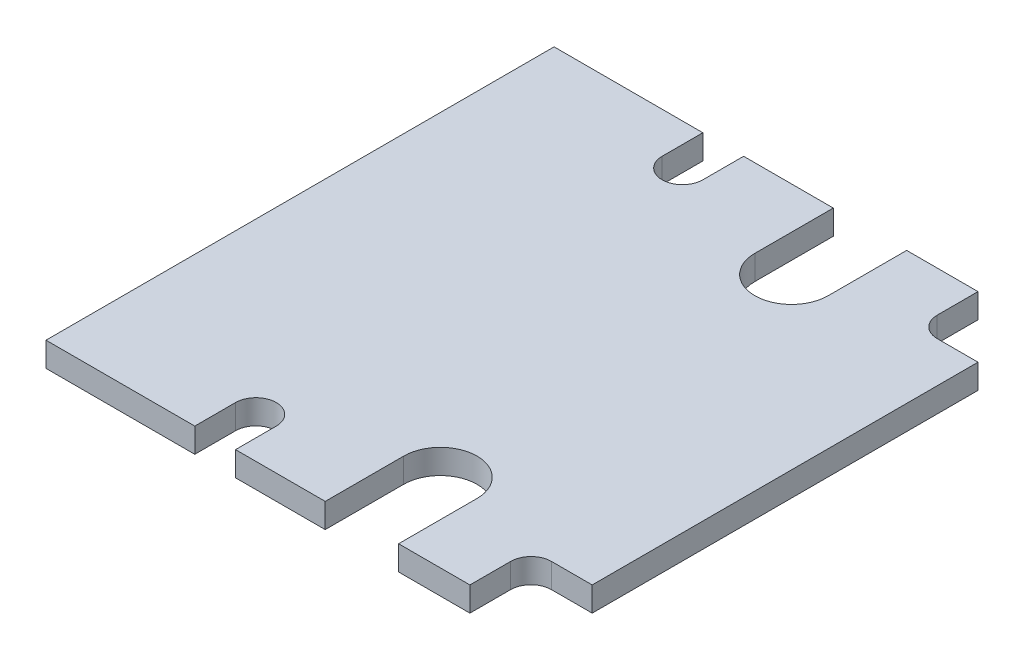
ISO-10303-21;
HEADER;
FILE_DESCRIPTION(('STEP AP214'),'2;1');
FILE_NAME('part.step','',(''),(''),'','','');
FILE_SCHEMA(('AUTOMOTIVE_DESIGN { 1 0 10303 214 1 1 1 1 }'));
ENDSEC;
DATA;
#1=APPLICATION_CONTEXT('core data for automotive mechanical design processes');
#2=APPLICATION_PROTOCOL_DEFINITION('international standard','automotive_design',2000,#1);
#3=PRODUCT_CONTEXT('',#1,'mechanical');
#4=PRODUCT('Part','Part','',(#3));
#5=PRODUCT_RELATED_PRODUCT_CATEGORY('part','',(#4));
#6=PRODUCT_DEFINITION_FORMATION('','',#4);
#7=PRODUCT_DEFINITION_CONTEXT('part definition',#1,'design');
#8=PRODUCT_DEFINITION('design','',#6,#7);
#9=PRODUCT_DEFINITION_SHAPE('','',#8);
#10=(LENGTH_UNIT() NAMED_UNIT(*) SI_UNIT(.MILLI.,.METRE.));
#11=(NAMED_UNIT(*) PLANE_ANGLE_UNIT() SI_UNIT($,.RADIAN.));
#12=(NAMED_UNIT(*) SI_UNIT($,.STERADIAN.) SOLID_ANGLE_UNIT());
#13=UNCERTAINTY_MEASURE_WITH_UNIT(LENGTH_MEASURE(1.E-05),#10,'distance_accuracy_value','');
#14=(GEOMETRIC_REPRESENTATION_CONTEXT(3) GLOBAL_UNCERTAINTY_ASSIGNED_CONTEXT((#13)) GLOBAL_UNIT_ASSIGNED_CONTEXT((#10,
#11,#12)) REPRESENTATION_CONTEXT('',''));
#15=CARTESIAN_POINT('',(0.,0.,0.));
#16=DIRECTION('',(0.,0.,1.));
#17=DIRECTION('',(1.,0.,0.));
#18=AXIS2_PLACEMENT_3D('',#15,#16,#17);
#19=CARTESIAN_POINT('',(-8.751968503937,1.2,13.9045406824147));
#20=DIRECTION('',(0.,0.,-1.));
#21=DIRECTION('',(-1.,0.,0.));
#22=AXIS2_PLACEMENT_3D('',#19,#20,#21);
#23=PLANE('',#22);
#24=DIRECTION('',(0.,1.,0.));
#25=VECTOR('',#24,1.);
#26=CARTESIAN_POINT('',(-0.751968503937004,0.,13.9045406824147));
#27=LINE('',#26,#25);
#28=CARTESIAN_POINT('',(-0.751968503937004,0.,13.9045406824147));
#29=VERTEX_POINT('',#28);
#30=CARTESIAN_POINT('',(-0.751968503937004,1.2,13.9045406824147));
#31=VERTEX_POINT('',#30);
#32=EDGE_CURVE('E239',#29,#31,#27,.T.);
#33=ORIENTED_EDGE('',*,*,#32,.F.);
#34=DIRECTION('',(1.,0.,0.));
#35=VECTOR('',#34,1.);
#36=CARTESIAN_POINT('',(-8.751968503937,0.,13.9045406824147));
#37=LINE('',#36,#35);
#38=CARTESIAN_POINT('',(2.74803149606299,0.,13.9045406824147));
#39=VERTEX_POINT('',#38);
#40=EDGE_CURVE('E318',#29,#39,#37,.T.);
#41=ORIENTED_EDGE('',*,*,#40,.T.);
#42=DIRECTION('',(0.,-1.,0.));
#43=VECTOR('',#42,1.);
#44=CARTESIAN_POINT('',(2.74803149606299,1.2,13.9045406824147));
#45=LINE('',#44,#43);
#46=CARTESIAN_POINT('',(2.74803149606299,1.2,13.9045406824147));
#47=VERTEX_POINT('',#46);
#48=EDGE_CURVE('E381',#47,#39,#45,.T.);
#49=ORIENTED_EDGE('',*,*,#48,.F.);
#50=DIRECTION('',(1.,0.,0.));
#51=VECTOR('',#50,1.);
#52=CARTESIAN_POINT('',(-8.751968503937,1.2,13.9045406824147));
#53=LINE('',#52,#51);
#54=EDGE_CURVE('E277',#31,#47,#53,.T.);
#55=ORIENTED_EDGE('',*,*,#54,.F.);
#56=EDGE_LOOP('',(#33,#41,#49,#55));
#57=FACE_BOUND('',#56,.T.);
#58=ADVANCED_FACE('F33',(#57),#23,.F.);
#59=DIRECTION('',(0.,1.,0.));
#60=VECTOR('',#59,1.);
#61=CARTESIAN_POINT('',(-4.351968503937,0.,13.9045406824147));
#62=LINE('',#61,#60);
#63=CARTESIAN_POINT('',(-4.351968503937,0.,13.9045406824147));
#64=VERTEX_POINT('',#63);
#65=CARTESIAN_POINT('',(-4.351968503937,1.2,13.9045406824147));
#66=VERTEX_POINT('',#65);
#67=EDGE_CURVE('E48',#64,#66,#62,.T.);
#68=ORIENTED_EDGE('',*,*,#67,.T.);
#69=CARTESIAN_POINT('',(-8.751968503937,1.2,13.9045406824147));
#70=VERTEX_POINT('',#69);
#71=EDGE_CURVE('E278',#70,#66,#53,.T.);
#72=ORIENTED_EDGE('',*,*,#71,.F.);
#73=DIRECTION('',(0.,-1.,0.));
#74=VECTOR('',#73,1.);
#75=CARTESIAN_POINT('',(-8.751968503937,1.2,13.9045406824147));
#76=LINE('',#75,#74);
#77=CARTESIAN_POINT('',(-8.751968503937,0.,13.9045406824147));
#78=VERTEX_POINT('',#77);
#79=EDGE_CURVE('E384',#70,#78,#76,.T.);
#80=ORIENTED_EDGE('',*,*,#79,.T.);
#81=EDGE_CURVE('E319',#78,#64,#37,.T.);
#82=ORIENTED_EDGE('',*,*,#81,.T.);
#83=EDGE_LOOP('',(#68,#72,#80,#82));
#84=FACE_BOUND('',#83,.T.);
#85=ADVANCED_FACE('F498',(#84),#23,.F.);
#86=CARTESIAN_POINT('',(-9.751968503937,1.2,11.9045406824147));
#87=DIRECTION('',(0.,1.,0.));
#88=DIRECTION('',(0.,0.,1.));
#89=AXIS2_PLACEMENT_3D('',#86,#87,#88);
#90=PLANE('',#89);
#91=CARTESIAN_POINT('',(-2.551968503937,1.2,10.0545406824147));
#92=DIRECTION('',(0.,-1.,0.));
#93=DIRECTION('',(0.,0.,-1.));
#94=AXIS2_PLACEMENT_3D('',#91,#92,#93);
#95=CIRCLE('',#94,1.8);
#96=CARTESIAN_POINT('',(-4.351968503937,1.2,10.0545406824147));
#97=VERTEX_POINT('',#96);
#98=CARTESIAN_POINT('',(-0.751968503937003,1.2,10.0545406824147));
#99=VERTEX_POINT('',#98);
#100=EDGE_CURVE('E221',#97,#99,#95,.T.);
#101=ORIENTED_EDGE('',*,*,#100,.T.);
#102=DIRECTION('',(0.,0.,1.));
#103=VECTOR('',#102,1.);
#104=CARTESIAN_POINT('',(-0.751968503937003,1.2,10.0545406824147));
#105=LINE('',#104,#103);
#106=EDGE_CURVE('E227',#99,#31,#105,.T.);
#107=ORIENTED_EDGE('',*,*,#106,.T.);
#108=ORIENTED_EDGE('',*,*,#54,.T.);
#109=DIRECTION('',(0.,0.,-1.));
#110=VECTOR('',#109,1.);
#111=CARTESIAN_POINT('',(2.748031496063,1.2,11.9045406824147));
#112=LINE('',#111,#110);
#113=CARTESIAN_POINT('',(2.748031496063,1.2,11.9045406824147));
#114=VERTEX_POINT('',#113);
#115=EDGE_CURVE('E281',#47,#114,#112,.T.);
#116=ORIENTED_EDGE('',*,*,#115,.T.);
#117=CARTESIAN_POINT('',(3.748031496063,1.2,11.9045406824147));
#118=DIRECTION('',(0.,-1.,0.));
#119=DIRECTION('',(0.,0.,1.));
#120=AXIS2_PLACEMENT_3D('',#117,#118,#119);
#121=CIRCLE('',#120,1.);
#122=CARTESIAN_POINT('',(3.748031496063,1.2,10.9045406824147));
#123=VERTEX_POINT('',#122);
#124=EDGE_CURVE('E283',#114,#123,#121,.T.);
#125=ORIENTED_EDGE('',*,*,#124,.T.);
#126=DIRECTION('',(1.,0.,0.));
#127=VECTOR('',#126,1.);
#128=CARTESIAN_POINT('',(3.748031496063,1.2,10.9045406824147));
#129=LINE('',#128,#127);
#130=CARTESIAN_POINT('',(5.748031496063,1.2,10.9045406824147));
#131=VERTEX_POINT('',#130);
#132=EDGE_CURVE('E285',#123,#131,#129,.T.);
#133=ORIENTED_EDGE('',*,*,#132,.T.);
#134=DIRECTION('',(0.,0.,-1.));
#135=VECTOR('',#134,1.);
#136=CARTESIAN_POINT('',(5.74803149606299,1.2,-8.0254593175853));
#137=LINE('',#136,#135);
#138=CARTESIAN_POINT('',(5.74803149606299,1.2,-8.0254593175853));
#139=VERTEX_POINT('',#138);
#140=EDGE_CURVE('E287',#131,#139,#137,.T.);
#141=ORIENTED_EDGE('',*,*,#140,.T.);
#142=DIRECTION('',(-1.,0.,0.));
#143=VECTOR('',#142,1.);
#144=CARTESIAN_POINT('',(3.748031496063,1.2,-8.0254593175853));
#145=LINE('',#144,#143);
#146=CARTESIAN_POINT('',(3.748031496063,1.2,-8.0254593175853));
#147=VERTEX_POINT('',#146);
#148=EDGE_CURVE('E289',#139,#147,#145,.T.);
#149=ORIENTED_EDGE('',*,*,#148,.T.);
#150=CARTESIAN_POINT('',(3.748031496063,1.2,-9.0254593175853));
#151=DIRECTION('',(0.,-1.,0.));
#152=DIRECTION('',(0.,0.,1.));
#153=AXIS2_PLACEMENT_3D('',#150,#151,#152);
#154=CIRCLE('',#153,1.);
#155=CARTESIAN_POINT('',(2.748031496063,1.2,-9.0254593175853));
#156=VERTEX_POINT('',#155);
#157=EDGE_CURVE('E291',#147,#156,#154,.T.);
#158=ORIENTED_EDGE('',*,*,#157,.T.);
#159=DIRECTION('',(0.,0.,-1.));
#160=VECTOR('',#159,1.);
#161=CARTESIAN_POINT('',(2.748031496063,1.2,-9.0254593175853));
#162=LINE('',#161,#160);
#163=CARTESIAN_POINT('',(2.74803149606299,1.2,-11.0254593175853));
#164=VERTEX_POINT('',#163);
#165=EDGE_CURVE('E293',#156,#164,#162,.T.);
#166=ORIENTED_EDGE('',*,*,#165,.T.);
#167=DIRECTION('',(-1.,0.,0.));
#168=VECTOR('',#167,1.);
#169=CARTESIAN_POINT('',(-8.751968503937,1.2,-11.0254593175853));
#170=LINE('',#169,#168);
#171=CARTESIAN_POINT('',(-0.751968503937004,1.2,-11.0254593175853));
#172=VERTEX_POINT('',#171);
#173=EDGE_CURVE('E296',#164,#172,#170,.T.);
#174=ORIENTED_EDGE('',*,*,#173,.T.);
#175=DIRECTION('',(0.,0.,-1.));
#176=VECTOR('',#175,1.);
#177=CARTESIAN_POINT('',(-0.751968503937003,1.2,-7.1754593175853));
#178=LINE('',#177,#176);
#179=CARTESIAN_POINT('',(-0.751968503937003,1.2,-7.1754593175853));
#180=VERTEX_POINT('',#179);
#181=EDGE_CURVE('E254',#180,#172,#178,.T.);
#182=ORIENTED_EDGE('',*,*,#181,.F.);
#183=CARTESIAN_POINT('',(-2.551968503937,1.2,-7.1754593175853));
#184=DIRECTION('',(0.,1.,0.));
#185=DIRECTION('',(0.,0.,1.));
#186=AXIS2_PLACEMENT_3D('',#183,#184,#185);
#187=CIRCLE('',#186,1.8);
#188=CARTESIAN_POINT('',(-4.351968503937,1.2,-7.1754593175853));
#189=VERTEX_POINT('',#188);
#190=EDGE_CURVE('E238',#189,#180,#187,.T.);
#191=ORIENTED_EDGE('',*,*,#190,.F.);
#192=DIRECTION('',(0.,0.,1.));
#193=VECTOR('',#192,1.);
#194=CARTESIAN_POINT('',(-4.351968503937,1.2,-7.1754593175853));
#195=LINE('',#194,#193);
#196=CARTESIAN_POINT('',(-4.351968503937,1.2,-11.0254593175853));
#197=VERTEX_POINT('',#196);
#198=EDGE_CURVE('E246',#197,#189,#195,.T.);
#199=ORIENTED_EDGE('',*,*,#198,.F.);
#200=CARTESIAN_POINT('',(-8.751968503937,1.2,-11.0254593175853));
#201=VERTEX_POINT('',#200);
#202=EDGE_CURVE('E295',#197,#201,#170,.T.);
#203=ORIENTED_EDGE('',*,*,#202,.T.);
#204=DIRECTION('',(0.,0.,1.));
#205=VECTOR('',#204,1.);
#206=CARTESIAN_POINT('',(-8.75196850393701,1.2,-9.0254593175853));
#207=LINE('',#206,#205);
#208=CARTESIAN_POINT('',(-8.75196850393701,1.2,-9.0254593175853));
#209=VERTEX_POINT('',#208);
#210=EDGE_CURVE('E299',#201,#209,#207,.T.);
#211=ORIENTED_EDGE('',*,*,#210,.T.);
#212=CARTESIAN_POINT('',(-9.75196850393701,1.2,-9.0254593175853));
#213=DIRECTION('',(0.,-1.,0.));
#214=DIRECTION('',(0.,0.,1.));
#215=AXIS2_PLACEMENT_3D('',#212,#213,#214);
#216=CIRCLE('',#215,1.);
#217=CARTESIAN_POINT('',(-10.751968503937,1.2,-9.0254593175853));
#218=VERTEX_POINT('',#217);
#219=EDGE_CURVE('E301',#209,#218,#216,.T.);
#220=ORIENTED_EDGE('',*,*,#219,.T.);
#221=DIRECTION('',(0.,0.,-1.));
#222=VECTOR('',#221,1.);
#223=CARTESIAN_POINT('',(-10.751968503937,1.2,-9.0254593175853));
#224=LINE('',#223,#222);
#225=CARTESIAN_POINT('',(-10.751968503937,1.2,-11.0254593175853));
#226=VERTEX_POINT('',#225);
#227=EDGE_CURVE('E303',#218,#226,#224,.T.);
#228=ORIENTED_EDGE('',*,*,#227,.T.);
#229=DIRECTION('',(-1.,0.,0.));
#230=VECTOR('',#229,1.);
#231=CARTESIAN_POINT('',(-18.051968503937,1.2,-11.0254593175853));
#232=LINE('',#231,#230);
#233=CARTESIAN_POINT('',(-18.051968503937,1.2,-11.0254593175853));
#234=VERTEX_POINT('',#233);
#235=EDGE_CURVE('E305',#226,#234,#232,.T.);
#236=ORIENTED_EDGE('',*,*,#235,.T.);
#237=DIRECTION('',(0.,0.,1.));
#238=VECTOR('',#237,1.);
#239=CARTESIAN_POINT('',(-18.051968503937,1.2,-11.0254593175853));
#240=LINE('',#239,#238);
#241=CARTESIAN_POINT('',(-18.051968503937,1.2,13.9045406824147));
#242=VERTEX_POINT('',#241);
#243=EDGE_CURVE('E265',#234,#242,#240,.T.);
#244=ORIENTED_EDGE('',*,*,#243,.T.);
#245=DIRECTION('',(1.,0.,0.));
#246=VECTOR('',#245,1.);
#247=CARTESIAN_POINT('',(-18.051968503937,1.2,13.9045406824147));
#248=LINE('',#247,#246);
#249=CARTESIAN_POINT('',(-10.751968503937,1.2,13.9045406824147));
#250=VERTEX_POINT('',#249);
#251=EDGE_CURVE('E268',#242,#250,#248,.T.);
#252=ORIENTED_EDGE('',*,*,#251,.T.);
#253=DIRECTION('',(0.,0.,-1.));
#254=VECTOR('',#253,1.);
#255=CARTESIAN_POINT('',(-10.751968503937,1.2,11.9045406824147));
#256=LINE('',#255,#254);
#257=CARTESIAN_POINT('',(-10.751968503937,1.2,11.9045406824147));
#258=VERTEX_POINT('',#257);
#259=EDGE_CURVE('E271',#250,#258,#256,.T.);
#260=ORIENTED_EDGE('',*,*,#259,.T.);
#261=CARTESIAN_POINT('',(-9.751968503937,1.2,11.9045406824147));
#262=DIRECTION('',(0.,-1.,0.));
#263=DIRECTION('',(0.,0.,1.));
#264=AXIS2_PLACEMENT_3D('',#261,#262,#263);
#265=CIRCLE('',#264,0.999999999999999);
#266=CARTESIAN_POINT('',(-8.751968503937,1.2,11.9045406824147));
#267=VERTEX_POINT('',#266);
#268=EDGE_CURVE('E273',#258,#267,#265,.T.);
#269=ORIENTED_EDGE('',*,*,#268,.T.);
#270=DIRECTION('',(0.,0.,1.));
#271=VECTOR('',#270,1.);
#272=CARTESIAN_POINT('',(-8.751968503937,1.2,11.9045406824147));
#273=LINE('',#272,#271);
#274=EDGE_CURVE('E275',#267,#70,#273,.T.);
#275=ORIENTED_EDGE('',*,*,#274,.T.);
#276=ORIENTED_EDGE('',*,*,#71,.T.);
#277=DIRECTION('',(0.,0.,-1.));
#278=VECTOR('',#277,1.);
#279=CARTESIAN_POINT('',(-4.351968503937,1.2,10.0545406824147));
#280=LINE('',#279,#278);
#281=EDGE_CURVE('E230',#66,#97,#280,.T.);
#282=ORIENTED_EDGE('',*,*,#281,.T.);
#283=EDGE_LOOP('',(#101,#107,#108,#116,#125,#133,#141,#149,#158,#166,#174,#182,#191,#199,#203,
#211,#220,#228,#236,#244,#252,#260,#269,#275,#276,#282));
#284=FACE_BOUND('',#283,.T.);
#285=ADVANCED_FACE('F413',(#284),#90,.T.);
#286=CARTESIAN_POINT('',(-9.751968503937,0.,11.9045406824147));
#287=DIRECTION('',(0.,1.,0.));
#288=DIRECTION('',(0.,0.,1.));
#289=AXIS2_PLACEMENT_3D('',#286,#287,#288);
#290=PLANE('',#289);
#291=DIRECTION('',(0.,0.,1.));
#292=VECTOR('',#291,1.);
#293=CARTESIAN_POINT('',(-0.751968503937003,0.,10.0545406824147));
#294=LINE('',#293,#292);
#295=CARTESIAN_POINT('',(-0.751968503937003,0.,10.0545406824147));
#296=VERTEX_POINT('',#295);
#297=EDGE_CURVE('E213',#296,#29,#294,.T.);
#298=ORIENTED_EDGE('',*,*,#297,.F.);
#299=CARTESIAN_POINT('',(-2.551968503937,0.,10.0545406824147));
#300=DIRECTION('',(0.,-1.,0.));
#301=DIRECTION('',(0.,0.,-1.));
#302=AXIS2_PLACEMENT_3D('',#299,#300,#301);
#303=CIRCLE('',#302,1.8);
#304=CARTESIAN_POINT('',(-4.351968503937,0.,10.0545406824147));
#305=VERTEX_POINT('',#304);
#306=EDGE_CURVE('E214',#305,#296,#303,.T.);
#307=ORIENTED_EDGE('',*,*,#306,.F.);
#308=DIRECTION('',(0.,0.,-1.));
#309=VECTOR('',#308,1.);
#310=CARTESIAN_POINT('',(-4.351968503937,0.,10.0545406824147));
#311=LINE('',#310,#309);
#312=EDGE_CURVE('E204',#64,#305,#311,.T.);
#313=ORIENTED_EDGE('',*,*,#312,.F.);
#314=ORIENTED_EDGE('',*,*,#81,.F.);
#315=DIRECTION('',(0.,0.,1.));
#316=VECTOR('',#315,1.);
#317=CARTESIAN_POINT('',(-8.751968503937,0.,11.9045406824147));
#318=LINE('',#317,#316);
#319=CARTESIAN_POINT('',(-8.751968503937,0.,11.9045406824147));
#320=VERTEX_POINT('',#319);
#321=EDGE_CURVE('E316',#320,#78,#318,.T.);
#322=ORIENTED_EDGE('',*,*,#321,.F.);
#323=CARTESIAN_POINT('',(-9.751968503937,0.,11.9045406824147));
#324=DIRECTION('',(0.,-1.,0.));
#325=DIRECTION('',(0.,0.,1.));
#326=AXIS2_PLACEMENT_3D('',#323,#324,#325);
#327=CIRCLE('',#326,0.999999999999999);
#328=CARTESIAN_POINT('',(-10.751968503937,0.,11.9045406824147));
#329=VERTEX_POINT('',#328);
#330=EDGE_CURVE('E314',#329,#320,#327,.T.);
#331=ORIENTED_EDGE('',*,*,#330,.F.);
#332=DIRECTION('',(0.,0.,-1.));
#333=VECTOR('',#332,1.);
#334=CARTESIAN_POINT('',(-10.751968503937,0.,11.9045406824147));
#335=LINE('',#334,#333);
#336=CARTESIAN_POINT('',(-10.751968503937,0.,13.9045406824147));
#337=VERTEX_POINT('',#336);
#338=EDGE_CURVE('E312',#337,#329,#335,.T.);
#339=ORIENTED_EDGE('',*,*,#338,.F.);
#340=DIRECTION('',(1.,0.,0.));
#341=VECTOR('',#340,1.);
#342=CARTESIAN_POINT('',(-18.051968503937,0.,13.9045406824147));
#343=LINE('',#342,#341);
#344=CARTESIAN_POINT('',(-18.051968503937,0.,13.9045406824147));
#345=VERTEX_POINT('',#344);
#346=EDGE_CURVE('E310',#345,#337,#343,.T.);
#347=ORIENTED_EDGE('',*,*,#346,.F.);
#348=DIRECTION('',(0.,0.,1.));
#349=VECTOR('',#348,1.);
#350=CARTESIAN_POINT('',(-18.051968503937,0.,-11.0254593175853));
#351=LINE('',#350,#349);
#352=CARTESIAN_POINT('',(-18.051968503937,0.,-11.0254593175853));
#353=VERTEX_POINT('',#352);
#354=EDGE_CURVE('E260',#353,#345,#351,.T.);
#355=ORIENTED_EDGE('',*,*,#354,.F.);
#356=DIRECTION('',(-1.,0.,0.));
#357=VECTOR('',#356,1.);
#358=CARTESIAN_POINT('',(-18.051968503937,0.,-11.0254593175853));
#359=LINE('',#358,#357);
#360=CARTESIAN_POINT('',(-10.751968503937,0.,-11.0254593175853));
#361=VERTEX_POINT('',#360);
#362=EDGE_CURVE('E269',#361,#353,#359,.T.);
#363=ORIENTED_EDGE('',*,*,#362,.F.);
#364=DIRECTION('',(0.,0.,-1.));
#365=VECTOR('',#364,1.);
#366=CARTESIAN_POINT('',(-10.751968503937,0.,-9.0254593175853));
#367=LINE('',#366,#365);
#368=CARTESIAN_POINT('',(-10.751968503937,0.,-9.0254593175853));
#369=VERTEX_POINT('',#368);
#370=EDGE_CURVE('E343',#369,#361,#367,.T.);
#371=ORIENTED_EDGE('',*,*,#370,.F.);
#372=CARTESIAN_POINT('',(-9.75196850393701,0.,-9.0254593175853));
#373=DIRECTION('',(0.,-1.,0.));
#374=DIRECTION('',(0.,0.,1.));
#375=AXIS2_PLACEMENT_3D('',#372,#373,#374);
#376=CIRCLE('',#375,1.);
#377=CARTESIAN_POINT('',(-8.75196850393701,0.,-9.0254593175853));
#378=VERTEX_POINT('',#377);
#379=EDGE_CURVE('E341',#378,#369,#376,.T.);
#380=ORIENTED_EDGE('',*,*,#379,.F.);
#381=DIRECTION('',(0.,0.,1.));
#382=VECTOR('',#381,1.);
#383=CARTESIAN_POINT('',(-8.75196850393701,0.,-9.0254593175853));
#384=LINE('',#383,#382);
#385=CARTESIAN_POINT('',(-8.751968503937,0.,-11.0254593175853));
#386=VERTEX_POINT('',#385);
#387=EDGE_CURVE('E339',#386,#378,#384,.T.);
#388=ORIENTED_EDGE('',*,*,#387,.F.);
#389=DIRECTION('',(-1.,0.,0.));
#390=VECTOR('',#389,1.);
#391=CARTESIAN_POINT('',(-8.751968503937,0.,-11.0254593175853));
#392=LINE('',#391,#390);
#393=CARTESIAN_POINT('',(-4.351968503937,0.,-11.0254593175853));
#394=VERTEX_POINT('',#393);
#395=EDGE_CURVE('E335',#394,#386,#392,.T.);
#396=ORIENTED_EDGE('',*,*,#395,.F.);
#397=DIRECTION('',(0.,0.,1.));
#398=VECTOR('',#397,1.);
#399=CARTESIAN_POINT('',(-4.351968503937,0.,-7.1754593175853));
#400=LINE('',#399,#398);
#401=CARTESIAN_POINT('',(-4.351968503937,0.,-7.1754593175853));
#402=VERTEX_POINT('',#401);
#403=EDGE_CURVE('E248',#394,#402,#400,.T.);
#404=ORIENTED_EDGE('',*,*,#403,.T.);
#405=CARTESIAN_POINT('',(-2.551968503937,0.,-7.1754593175853));
#406=DIRECTION('',(0.,1.,0.));
#407=DIRECTION('',(0.,0.,1.));
#408=AXIS2_PLACEMENT_3D('',#405,#406,#407);
#409=CIRCLE('',#408,1.8);
#410=CARTESIAN_POINT('',(-0.751968503937003,0.,-7.1754593175853));
#411=VERTEX_POINT('',#410);
#412=EDGE_CURVE('E242',#402,#411,#409,.T.);
#413=ORIENTED_EDGE('',*,*,#412,.T.);
#414=DIRECTION('',(0.,0.,-1.));
#415=VECTOR('',#414,1.);
#416=CARTESIAN_POINT('',(-0.751968503937003,0.,-7.1754593175853));
#417=LINE('',#416,#415);
#418=CARTESIAN_POINT('',(-0.751968503937004,0.,-11.0254593175853));
#419=VERTEX_POINT('',#418);
#420=EDGE_CURVE('E245',#411,#419,#417,.T.);
#421=ORIENTED_EDGE('',*,*,#420,.T.);
#422=CARTESIAN_POINT('',(2.74803149606299,0.,-11.0254593175853));
#423=VERTEX_POINT('',#422);
#424=EDGE_CURVE('E336',#423,#419,#392,.T.);
#425=ORIENTED_EDGE('',*,*,#424,.F.);
#426=DIRECTION('',(0.,0.,-1.));
#427=VECTOR('',#426,1.);
#428=CARTESIAN_POINT('',(2.748031496063,0.,-9.0254593175853));
#429=LINE('',#428,#427);
#430=CARTESIAN_POINT('',(2.748031496063,0.,-9.0254593175853));
#431=VERTEX_POINT('',#430);
#432=EDGE_CURVE('E333',#431,#423,#429,.T.);
#433=ORIENTED_EDGE('',*,*,#432,.F.);
#434=CARTESIAN_POINT('',(3.748031496063,0.,-9.0254593175853));
#435=DIRECTION('',(0.,-1.,0.));
#436=DIRECTION('',(0.,0.,1.));
#437=AXIS2_PLACEMENT_3D('',#434,#435,#436);
#438=CIRCLE('',#437,1.);
#439=CARTESIAN_POINT('',(3.748031496063,0.,-8.0254593175853));
#440=VERTEX_POINT('',#439);
#441=EDGE_CURVE('E331',#440,#431,#438,.T.);
#442=ORIENTED_EDGE('',*,*,#441,.F.);
#443=DIRECTION('',(-1.,0.,0.));
#444=VECTOR('',#443,1.);
#445=CARTESIAN_POINT('',(3.748031496063,0.,-8.0254593175853));
#446=LINE('',#445,#444);
#447=CARTESIAN_POINT('',(5.74803149606299,0.,-8.0254593175853));
#448=VERTEX_POINT('',#447);
#449=EDGE_CURVE('E329',#448,#440,#446,.T.);
#450=ORIENTED_EDGE('',*,*,#449,.F.);
#451=DIRECTION('',(0.,0.,-1.));
#452=VECTOR('',#451,1.);
#453=CARTESIAN_POINT('',(5.74803149606299,0.,-8.0254593175853));
#454=LINE('',#453,#452);
#455=CARTESIAN_POINT('',(5.748031496063,0.,10.9045406824147));
#456=VERTEX_POINT('',#455);
#457=EDGE_CURVE('E327',#456,#448,#454,.T.);
#458=ORIENTED_EDGE('',*,*,#457,.F.);
#459=DIRECTION('',(1.,0.,0.));
#460=VECTOR('',#459,1.);
#461=CARTESIAN_POINT('',(3.748031496063,0.,10.9045406824147));
#462=LINE('',#461,#460);
#463=CARTESIAN_POINT('',(3.748031496063,0.,10.9045406824147));
#464=VERTEX_POINT('',#463);
#465=EDGE_CURVE('E325',#464,#456,#462,.T.);
#466=ORIENTED_EDGE('',*,*,#465,.F.);
#467=CARTESIAN_POINT('',(3.748031496063,0.,11.9045406824147));
#468=DIRECTION('',(0.,-1.,0.));
#469=DIRECTION('',(0.,0.,1.));
#470=AXIS2_PLACEMENT_3D('',#467,#468,#469);
#471=CIRCLE('',#470,1.);
#472=CARTESIAN_POINT('',(2.748031496063,0.,11.9045406824147));
#473=VERTEX_POINT('',#472);
#474=EDGE_CURVE('E323',#473,#464,#471,.T.);
#475=ORIENTED_EDGE('',*,*,#474,.F.);
#476=DIRECTION('',(0.,0.,-1.));
#477=VECTOR('',#476,1.);
#478=CARTESIAN_POINT('',(2.748031496063,0.,11.9045406824147));
#479=LINE('',#478,#477);
#480=EDGE_CURVE('E321',#39,#473,#479,.T.);
#481=ORIENTED_EDGE('',*,*,#480,.F.);
#482=ORIENTED_EDGE('',*,*,#40,.F.);
#483=EDGE_LOOP('',(#298,#307,#313,#314,#322,#331,#339,#347,#355,#363,#371,#380,#388,#396,#404,
#413,#421,#425,#433,#442,#450,#458,#466,#475,#481,#482));
#484=FACE_BOUND('',#483,.T.);
#485=ADVANCED_FACE('F225',(#484),#290,.F.);
#486=CARTESIAN_POINT('',(-8.751968503937,1.2,-11.0254593175853));
#487=DIRECTION('',(0.,0.,1.));
#488=DIRECTION('',(1.,0.,0.));
#489=AXIS2_PLACEMENT_3D('',#486,#487,#488);
#490=PLANE('',#489);
#491=ORIENTED_EDGE('',*,*,#202,.F.);
#492=DIRECTION('',(0.,1.,0.));
#493=VECTOR('',#492,1.);
#494=CARTESIAN_POINT('',(-4.351968503937,0.,-11.0254593175853));
#495=LINE('',#494,#493);
#496=EDGE_CURVE('E261',#394,#197,#495,.T.);
#497=ORIENTED_EDGE('',*,*,#496,.F.);
#498=ORIENTED_EDGE('',*,*,#395,.T.);
#499=DIRECTION('',(0.,-1.,0.));
#500=VECTOR('',#499,1.);
#501=CARTESIAN_POINT('',(-8.751968503937,1.2,-11.0254593175853));
#502=LINE('',#501,#500);
#503=EDGE_CURVE('E357',#201,#386,#502,.T.);
#504=ORIENTED_EDGE('',*,*,#503,.F.);
#505=EDGE_LOOP('',(#491,#497,#498,#504));
#506=FACE_BOUND('',#505,.T.);
#507=ADVANCED_FACE('F442',(#506),#490,.F.);
#508=CARTESIAN_POINT('',(-18.051968503937,1.2,-11.0254593175853));
#509=DIRECTION('',(1.,0.,0.));
#510=DIRECTION('',(0.,0.,-1.));
#511=AXIS2_PLACEMENT_3D('',#508,#509,#510);
#512=PLANE('',#511);
#513=ORIENTED_EDGE('',*,*,#354,.T.);
#514=DIRECTION('',(0.,-1.,0.));
#515=VECTOR('',#514,1.);
#516=CARTESIAN_POINT('',(-18.051968503937,1.2,13.9045406824147));
#517=LINE('',#516,#515);
#518=EDGE_CURVE('E11',#242,#345,#517,.T.);
#519=ORIENTED_EDGE('',*,*,#518,.F.);
#520=ORIENTED_EDGE('',*,*,#243,.F.);
#521=DIRECTION('',(0.,-1.,0.));
#522=VECTOR('',#521,1.);
#523=CARTESIAN_POINT('',(-18.051968503937,1.2,-11.0254593175853));
#524=LINE('',#523,#522);
#525=EDGE_CURVE('E307',#234,#353,#524,.T.);
#526=ORIENTED_EDGE('',*,*,#525,.T.);
#527=EDGE_LOOP('',(#513,#519,#520,#526));
#528=FACE_BOUND('',#527,.T.);
#529=ADVANCED_FACE('F35',(#528),#512,.F.);
#530=CARTESIAN_POINT('',(-18.051968503937,1.2,13.9045406824147));
#531=DIRECTION('',(0.,0.,-1.));
#532=DIRECTION('',(-1.,0.,0.));
#533=AXIS2_PLACEMENT_3D('',#530,#531,#532);
#534=PLANE('',#533);
#535=ORIENTED_EDGE('',*,*,#346,.T.);
#536=DIRECTION('',(0.,-1.,0.));
#537=VECTOR('',#536,1.);
#538=CARTESIAN_POINT('',(-10.751968503937,1.2,13.9045406824147));
#539=LINE('',#538,#537);
#540=EDGE_CURVE('E41',#250,#337,#539,.T.);
#541=ORIENTED_EDGE('',*,*,#540,.F.);
#542=ORIENTED_EDGE('',*,*,#251,.F.);
#543=ORIENTED_EDGE('',*,*,#518,.T.);
#544=EDGE_LOOP('',(#535,#541,#542,#543));
#545=FACE_BOUND('',#544,.T.);
#546=ADVANCED_FACE('F416',(#545),#534,.F.);
#547=CARTESIAN_POINT('',(-10.751968503937,1.2,11.9045406824147));
#548=DIRECTION('',(-1.,0.,0.));
#549=DIRECTION('',(0.,0.,1.));
#550=AXIS2_PLACEMENT_3D('',#547,#548,#549);
#551=PLANE('',#550);
#552=ORIENTED_EDGE('',*,*,#338,.T.);
#553=DIRECTION('',(0.,-1.,0.));
#554=VECTOR('',#553,1.);
#555=CARTESIAN_POINT('',(-10.751968503937,1.2,11.9045406824147));
#556=LINE('',#555,#554);
#557=EDGE_CURVE('E390',#258,#329,#556,.T.);
#558=ORIENTED_EDGE('',*,*,#557,.F.);
#559=ORIENTED_EDGE('',*,*,#259,.F.);
#560=ORIENTED_EDGE('',*,*,#540,.T.);
#561=EDGE_LOOP('',(#552,#558,#559,#560));
#562=FACE_BOUND('',#561,.T.);
#563=ADVANCED_FACE('F397',(#562),#551,.F.);
#564=CARTESIAN_POINT('',(-9.751968503937,1.2,11.9045406824147));
#565=DIRECTION('',(0.,-1.,0.));
#566=DIRECTION('',(0.,0.,-1.));
#567=AXIS2_PLACEMENT_3D('',#564,#565,#566);
#568=CYLINDRICAL_SURFACE('',#567,0.999999999999999);
#569=ORIENTED_EDGE('',*,*,#330,.T.);
#570=DIRECTION('',(0.,-1.,0.));
#571=VECTOR('',#570,1.);
#572=CARTESIAN_POINT('',(-8.751968503937,1.2,11.9045406824147));
#573=LINE('',#572,#571);
#574=EDGE_CURVE('E387',#267,#320,#573,.T.);
#575=ORIENTED_EDGE('',*,*,#574,.F.);
#576=ORIENTED_EDGE('',*,*,#268,.F.);
#577=ORIENTED_EDGE('',*,*,#557,.T.);
#578=EDGE_LOOP('',(#569,#575,#576,#577));
#579=FACE_BOUND('',#578,.T.);
#580=ADVANCED_FACE('F405',(#579),#568,.F.);
#581=CARTESIAN_POINT('',(-8.751968503937,1.2,11.9045406824147));
#582=DIRECTION('',(1.,0.,0.));
#583=DIRECTION('',(0.,0.,-1.));
#584=AXIS2_PLACEMENT_3D('',#581,#582,#583);
#585=PLANE('',#584);
#586=ORIENTED_EDGE('',*,*,#321,.T.);
#587=ORIENTED_EDGE('',*,*,#79,.F.);
#588=ORIENTED_EDGE('',*,*,#274,.F.);
#589=ORIENTED_EDGE('',*,*,#574,.T.);
#590=EDGE_LOOP('',(#586,#587,#588,#589));
#591=FACE_BOUND('',#590,.T.);
#592=ADVANCED_FACE('F409',(#591),#585,.F.);
#593=CARTESIAN_POINT('',(2.748031496063,1.2,11.9045406824147));
#594=DIRECTION('',(-1.,0.,0.));
#595=DIRECTION('',(0.,0.,1.));
#596=AXIS2_PLACEMENT_3D('',#593,#594,#595);
#597=PLANE('',#596);
#598=ORIENTED_EDGE('',*,*,#480,.T.);
#599=DIRECTION('',(0.,-1.,0.));
#600=VECTOR('',#599,1.);
#601=CARTESIAN_POINT('',(2.748031496063,1.2,11.9045406824147));
#602=LINE('',#601,#600);
#603=EDGE_CURVE('E378',#114,#473,#602,.T.);
#604=ORIENTED_EDGE('',*,*,#603,.F.);
#605=ORIENTED_EDGE('',*,*,#115,.F.);
#606=ORIENTED_EDGE('',*,*,#48,.T.);
#607=EDGE_LOOP('',(#598,#604,#605,#606));
#608=FACE_BOUND('',#607,.T.);
#609=ADVANCED_FACE('F490',(#608),#597,.F.);
#610=CARTESIAN_POINT('',(3.748031496063,1.2,11.9045406824147));
#611=DIRECTION('',(0.,-1.,0.));
#612=DIRECTION('',(0.,0.,-1.));
#613=AXIS2_PLACEMENT_3D('',#610,#611,#612);
#614=CYLINDRICAL_SURFACE('',#613,1.);
#615=ORIENTED_EDGE('',*,*,#474,.T.);
#616=DIRECTION('',(0.,-1.,0.));
#617=VECTOR('',#616,1.);
#618=CARTESIAN_POINT('',(3.748031496063,1.2,10.9045406824147));
#619=LINE('',#618,#617);
#620=EDGE_CURVE('E375',#123,#464,#619,.T.);
#621=ORIENTED_EDGE('',*,*,#620,.F.);
#622=ORIENTED_EDGE('',*,*,#124,.F.);
#623=ORIENTED_EDGE('',*,*,#603,.T.);
#624=EDGE_LOOP('',(#615,#621,#622,#623));
#625=FACE_BOUND('',#624,.T.);
#626=ADVANCED_FACE('F486',(#625),#614,.F.);
#627=CARTESIAN_POINT('',(3.748031496063,1.2,10.9045406824147));
#628=DIRECTION('',(0.,0.,-1.));
#629=DIRECTION('',(-1.,0.,0.));
#630=AXIS2_PLACEMENT_3D('',#627,#628,#629);
#631=PLANE('',#630);
#632=ORIENTED_EDGE('',*,*,#465,.T.);
#633=DIRECTION('',(0.,-1.,0.));
#634=VECTOR('',#633,1.);
#635=CARTESIAN_POINT('',(5.748031496063,1.2,10.9045406824147));
#636=LINE('',#635,#634);
#637=EDGE_CURVE('E372',#131,#456,#636,.T.);
#638=ORIENTED_EDGE('',*,*,#637,.F.);
#639=ORIENTED_EDGE('',*,*,#132,.F.);
#640=ORIENTED_EDGE('',*,*,#620,.T.);
#641=EDGE_LOOP('',(#632,#638,#639,#640));
#642=FACE_BOUND('',#641,.T.);
#643=ADVANCED_FACE('F481',(#642),#631,.F.);
#644=CARTESIAN_POINT('',(5.74803149606299,1.2,-8.0254593175853));
#645=DIRECTION('',(-1.,0.,0.));
#646=DIRECTION('',(0.,0.,1.));
#647=AXIS2_PLACEMENT_3D('',#644,#645,#646);
#648=PLANE('',#647);
#649=ORIENTED_EDGE('',*,*,#457,.T.);
#650=DIRECTION('',(0.,-1.,0.));
#651=VECTOR('',#650,1.);
#652=CARTESIAN_POINT('',(5.74803149606299,1.2,-8.0254593175853));
#653=LINE('',#652,#651);
#654=EDGE_CURVE('E369',#139,#448,#653,.T.);
#655=ORIENTED_EDGE('',*,*,#654,.F.);
#656=ORIENTED_EDGE('',*,*,#140,.F.);
#657=ORIENTED_EDGE('',*,*,#637,.T.);
#658=EDGE_LOOP('',(#649,#655,#656,#657));
#659=FACE_BOUND('',#658,.T.);
#660=ADVANCED_FACE('F475',(#659),#648,.F.);
#661=CARTESIAN_POINT('',(3.748031496063,1.2,-8.0254593175853));
#662=DIRECTION('',(0.,0.,1.));
#663=DIRECTION('',(1.,0.,0.));
#664=AXIS2_PLACEMENT_3D('',#661,#662,#663);
#665=PLANE('',#664);
#666=ORIENTED_EDGE('',*,*,#449,.T.);
#667=DIRECTION('',(0.,-1.,0.));
#668=VECTOR('',#667,1.);
#669=CARTESIAN_POINT('',(3.748031496063,1.2,-8.0254593175853));
#670=LINE('',#669,#668);
#671=EDGE_CURVE('E366',#147,#440,#670,.T.);
#672=ORIENTED_EDGE('',*,*,#671,.F.);
#673=ORIENTED_EDGE('',*,*,#148,.F.);
#674=ORIENTED_EDGE('',*,*,#654,.T.);
#675=EDGE_LOOP('',(#666,#672,#673,#674));
#676=FACE_BOUND('',#675,.T.);
#677=ADVANCED_FACE('F471',(#676),#665,.F.);
#678=CARTESIAN_POINT('',(3.748031496063,1.2,-9.0254593175853));
#679=DIRECTION('',(0.,-1.,0.));
#680=DIRECTION('',(0.,0.,-1.));
#681=AXIS2_PLACEMENT_3D('',#678,#679,#680);
#682=CYLINDRICAL_SURFACE('',#681,1.);
#683=ORIENTED_EDGE('',*,*,#441,.T.);
#684=DIRECTION('',(0.,-1.,0.));
#685=VECTOR('',#684,1.);
#686=CARTESIAN_POINT('',(2.748031496063,1.2,-9.0254593175853));
#687=LINE('',#686,#685);
#688=EDGE_CURVE('E363',#156,#431,#687,.T.);
#689=ORIENTED_EDGE('',*,*,#688,.F.);
#690=ORIENTED_EDGE('',*,*,#157,.F.);
#691=ORIENTED_EDGE('',*,*,#671,.T.);
#692=EDGE_LOOP('',(#683,#689,#690,#691));
#693=FACE_BOUND('',#692,.T.);
#694=ADVANCED_FACE('F466',(#693),#682,.F.);
#695=CARTESIAN_POINT('',(2.748031496063,1.2,-9.0254593175853));
#696=DIRECTION('',(-1.,0.,0.));
#697=DIRECTION('',(0.,0.,1.));
#698=AXIS2_PLACEMENT_3D('',#695,#696,#697);
#699=PLANE('',#698);
#700=ORIENTED_EDGE('',*,*,#432,.T.);
#701=DIRECTION('',(0.,-1.,0.));
#702=VECTOR('',#701,1.);
#703=CARTESIAN_POINT('',(2.74803149606299,1.2,-11.0254593175853));
#704=LINE('',#703,#702);
#705=EDGE_CURVE('E360',#164,#423,#704,.T.);
#706=ORIENTED_EDGE('',*,*,#705,.F.);
#707=ORIENTED_EDGE('',*,*,#165,.F.);
#708=ORIENTED_EDGE('',*,*,#688,.T.);
#709=EDGE_LOOP('',(#700,#706,#707,#708));
#710=FACE_BOUND('',#709,.T.);
#711=ADVANCED_FACE('F460',(#710),#699,.F.);
#712=ORIENTED_EDGE('',*,*,#424,.T.);
#713=DIRECTION('',(0.,1.,0.));
#714=VECTOR('',#713,1.);
#715=CARTESIAN_POINT('',(-0.751968503937004,0.,-11.0254593175853));
#716=LINE('',#715,#714);
#717=EDGE_CURVE('E56',#419,#172,#716,.T.);
#718=ORIENTED_EDGE('',*,*,#717,.T.);
#719=ORIENTED_EDGE('',*,*,#173,.F.);
#720=ORIENTED_EDGE('',*,*,#705,.T.);
#721=EDGE_LOOP('',(#712,#718,#719,#720));
#722=FACE_BOUND('',#721,.T.);
#723=ADVANCED_FACE('F455',(#722),#490,.F.);
#724=CARTESIAN_POINT('',(-8.75196850393701,1.2,-9.0254593175853));
#725=DIRECTION('',(1.,0.,0.));
#726=DIRECTION('',(0.,0.,-1.));
#727=AXIS2_PLACEMENT_3D('',#724,#725,#726);
#728=PLANE('',#727);
#729=ORIENTED_EDGE('',*,*,#387,.T.);
#730=DIRECTION('',(0.,-1.,0.));
#731=VECTOR('',#730,1.);
#732=CARTESIAN_POINT('',(-8.75196850393701,1.2,-9.0254593175853));
#733=LINE('',#732,#731);
#734=EDGE_CURVE('E354',#209,#378,#733,.T.);
#735=ORIENTED_EDGE('',*,*,#734,.F.);
#736=ORIENTED_EDGE('',*,*,#210,.F.);
#737=ORIENTED_EDGE('',*,*,#503,.T.);
#738=EDGE_LOOP('',(#729,#735,#736,#737));
#739=FACE_BOUND('',#738,.T.);
#740=ADVANCED_FACE('F437',(#739),#728,.F.);
#741=CARTESIAN_POINT('',(-9.75196850393701,1.2,-9.0254593175853));
#742=DIRECTION('',(0.,-1.,0.));
#743=DIRECTION('',(0.,0.,-1.));
#744=AXIS2_PLACEMENT_3D('',#741,#742,#743);
#745=CYLINDRICAL_SURFACE('',#744,1.);
#746=ORIENTED_EDGE('',*,*,#379,.T.);
#747=DIRECTION('',(0.,-1.,0.));
#748=VECTOR('',#747,1.);
#749=CARTESIAN_POINT('',(-10.751968503937,1.2,-9.0254593175853));
#750=LINE('',#749,#748);
#751=EDGE_CURVE('E351',#218,#369,#750,.T.);
#752=ORIENTED_EDGE('',*,*,#751,.F.);
#753=ORIENTED_EDGE('',*,*,#219,.F.);
#754=ORIENTED_EDGE('',*,*,#734,.T.);
#755=EDGE_LOOP('',(#746,#752,#753,#754));
#756=FACE_BOUND('',#755,.T.);
#757=ADVANCED_FACE('F432',(#756),#745,.F.);
#758=CARTESIAN_POINT('',(-10.751968503937,1.2,-9.0254593175853));
#759=DIRECTION('',(-1.,0.,0.));
#760=DIRECTION('',(0.,0.,1.));
#761=AXIS2_PLACEMENT_3D('',#758,#759,#760);
#762=PLANE('',#761);
#763=ORIENTED_EDGE('',*,*,#370,.T.);
#764=DIRECTION('',(0.,-1.,0.));
#765=VECTOR('',#764,1.);
#766=CARTESIAN_POINT('',(-10.751968503937,1.2,-11.0254593175853));
#767=LINE('',#766,#765);
#768=EDGE_CURVE('E348',#226,#361,#767,.T.);
#769=ORIENTED_EDGE('',*,*,#768,.F.);
#770=ORIENTED_EDGE('',*,*,#227,.F.);
#771=ORIENTED_EDGE('',*,*,#751,.T.);
#772=EDGE_LOOP('',(#763,#769,#770,#771));
#773=FACE_BOUND('',#772,.T.);
#774=ADVANCED_FACE('F428',(#773),#762,.F.);
#775=CARTESIAN_POINT('',(-18.051968503937,1.2,-11.0254593175853));
#776=DIRECTION('',(0.,0.,1.));
#777=DIRECTION('',(1.,0.,0.));
#778=AXIS2_PLACEMENT_3D('',#775,#776,#777);
#779=PLANE('',#778);
#780=ORIENTED_EDGE('',*,*,#362,.T.);
#781=ORIENTED_EDGE('',*,*,#525,.F.);
#782=ORIENTED_EDGE('',*,*,#235,.F.);
#783=ORIENTED_EDGE('',*,*,#768,.T.);
#784=EDGE_LOOP('',(#780,#781,#782,#783));
#785=FACE_BOUND('',#784,.T.);
#786=ADVANCED_FACE('F423',(#785),#779,.F.);
#787=CARTESIAN_POINT('',(-2.551968503937,0.,-7.1754593175853));
#788=DIRECTION('',(0.,1.,0.));
#789=DIRECTION('',(0.,0.,1.));
#790=AXIS2_PLACEMENT_3D('',#787,#788,#789);
#791=CYLINDRICAL_SURFACE('',#790,1.8);
#792=ORIENTED_EDGE('',*,*,#190,.T.);
#793=DIRECTION('',(0.,1.,0.));
#794=VECTOR('',#793,1.);
#795=CARTESIAN_POINT('',(-0.751968503937003,0.,-7.1754593175853));
#796=LINE('',#795,#794);
#797=EDGE_CURVE('E251',#411,#180,#796,.T.);
#798=ORIENTED_EDGE('',*,*,#797,.F.);
#799=ORIENTED_EDGE('',*,*,#412,.F.);
#800=DIRECTION('',(0.,1.,0.));
#801=VECTOR('',#800,1.);
#802=CARTESIAN_POINT('',(-4.351968503937,0.,-7.1754593175853));
#803=LINE('',#802,#801);
#804=EDGE_CURVE('E258',#402,#189,#803,.T.);
#805=ORIENTED_EDGE('',*,*,#804,.T.);
#806=EDGE_LOOP('',(#792,#798,#799,#805));
#807=FACE_BOUND('',#806,.T.);
#808=ADVANCED_FACE('F450',(#807),#791,.F.);
#809=CARTESIAN_POINT('',(-4.351968503937,0.,-7.1754593175853));
#810=DIRECTION('',(-1.,0.,0.));
#811=DIRECTION('',(0.,0.,1.));
#812=AXIS2_PLACEMENT_3D('',#809,#810,#811);
#813=PLANE('',#812);
#814=ORIENTED_EDGE('',*,*,#198,.T.);
#815=ORIENTED_EDGE('',*,*,#804,.F.);
#816=ORIENTED_EDGE('',*,*,#403,.F.);
#817=ORIENTED_EDGE('',*,*,#496,.T.);
#818=EDGE_LOOP('',(#814,#815,#816,#817));
#819=FACE_BOUND('',#818,.T.);
#820=ADVANCED_FACE('F446',(#819),#813,.F.);
#821=CARTESIAN_POINT('',(-0.751968503937003,0.,-7.1754593175853));
#822=DIRECTION('',(1.,0.,0.));
#823=DIRECTION('',(0.,0.,-1.));
#824=AXIS2_PLACEMENT_3D('',#821,#822,#823);
#825=PLANE('',#824);
#826=ORIENTED_EDGE('',*,*,#181,.T.);
#827=ORIENTED_EDGE('',*,*,#717,.F.);
#828=ORIENTED_EDGE('',*,*,#420,.F.);
#829=ORIENTED_EDGE('',*,*,#797,.T.);
#830=EDGE_LOOP('',(#826,#827,#828,#829));
#831=FACE_BOUND('',#830,.T.);
#832=ADVANCED_FACE('F654',(#831),#825,.F.);
#833=CARTESIAN_POINT('',(-2.551968503937,0.,10.0545406824147));
#834=DIRECTION('',(0.,1.,0.));
#835=DIRECTION('',(0.,0.,1.));
#836=AXIS2_PLACEMENT_3D('',#833,#834,#835);
#837=CYLINDRICAL_SURFACE('',#836,1.8);
#838=ORIENTED_EDGE('',*,*,#100,.F.);
#839=DIRECTION('',(0.,1.,0.));
#840=VECTOR('',#839,1.);
#841=CARTESIAN_POINT('',(-4.351968503937,0.,10.0545406824147));
#842=LINE('',#841,#840);
#843=EDGE_CURVE('E207',#305,#97,#842,.T.);
#844=ORIENTED_EDGE('',*,*,#843,.F.);
#845=ORIENTED_EDGE('',*,*,#306,.T.);
#846=DIRECTION('',(0.,1.,0.));
#847=VECTOR('',#846,1.);
#848=CARTESIAN_POINT('',(-0.751968503937003,0.,10.0545406824147));
#849=LINE('',#848,#847);
#850=EDGE_CURVE('E236',#296,#99,#849,.T.);
#851=ORIENTED_EDGE('',*,*,#850,.T.);
#852=EDGE_LOOP('',(#838,#844,#845,#851));
#853=FACE_BOUND('',#852,.T.);
#854=ADVANCED_FACE('F217',(#853),#837,.F.);
#855=CARTESIAN_POINT('',(-0.751968503937003,0.,10.0545406824147));
#856=DIRECTION('',(-1.,0.,0.));
#857=DIRECTION('',(0.,0.,1.));
#858=AXIS2_PLACEMENT_3D('',#855,#856,#857);
#859=PLANE('',#858);
#860=ORIENTED_EDGE('',*,*,#106,.F.);
#861=ORIENTED_EDGE('',*,*,#850,.F.);
#862=ORIENTED_EDGE('',*,*,#297,.T.);
#863=ORIENTED_EDGE('',*,*,#32,.T.);
#864=EDGE_LOOP('',(#860,#861,#862,#863));
#865=FACE_BOUND('',#864,.T.);
#866=ADVANCED_FACE('F496',(#865),#859,.T.);
#867=CARTESIAN_POINT('',(-4.351968503937,0.,10.0545406824147));
#868=DIRECTION('',(1.,0.,0.));
#869=DIRECTION('',(0.,0.,-1.));
#870=AXIS2_PLACEMENT_3D('',#867,#868,#869);
#871=PLANE('',#870);
#872=ORIENTED_EDGE('',*,*,#281,.F.);
#873=ORIENTED_EDGE('',*,*,#67,.F.);
#874=ORIENTED_EDGE('',*,*,#312,.T.);
#875=ORIENTED_EDGE('',*,*,#843,.T.);
#876=EDGE_LOOP('',(#872,#873,#874,#875));
#877=FACE_BOUND('',#876,.T.);
#878=ADVANCED_FACE('F206',(#877),#871,.T.);
#879=CLOSED_SHELL('',(#58,#85,#285,#485,#507,#529,#546,#563,#580,#592,#609,#626,#643,#660,#677,
#694,#711,#723,#740,#757,#774,#786,#808,#820,#832,#854,#866,#878));
#880=MANIFOLD_SOLID_BREP('B2',#879);
#881=ADVANCED_BREP_SHAPE_REPRESENTATION('',(#18,#880),#14);
#882=SHAPE_DEFINITION_REPRESENTATION(#9,#881);
ENDSEC;
END-ISO-10303-21;
